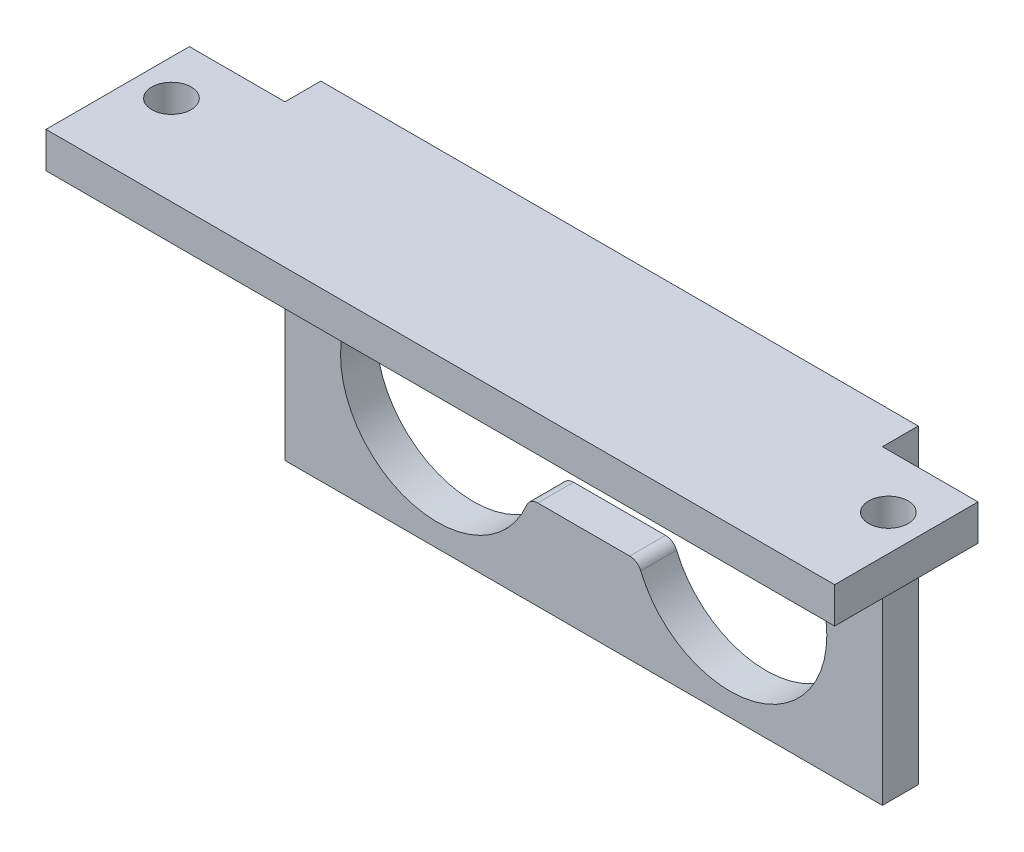
ISO-10303-21;
HEADER;
FILE_DESCRIPTION(('STEP AP214'),'2;1');
FILE_NAME('part.step','',(''),(''),'','','');
FILE_SCHEMA(('AUTOMOTIVE_DESIGN { 1 0 10303 214 1 1 1 1 }'));
ENDSEC;
DATA;
#1=APPLICATION_CONTEXT('core data for automotive mechanical design processes');
#2=APPLICATION_PROTOCOL_DEFINITION('international standard','automotive_design',2000,#1);
#3=PRODUCT_CONTEXT('',#1,'mechanical');
#4=PRODUCT('Part','Part','',(#3));
#5=PRODUCT_RELATED_PRODUCT_CATEGORY('part','',(#4));
#6=PRODUCT_DEFINITION_FORMATION('','',#4);
#7=PRODUCT_DEFINITION_CONTEXT('part definition',#1,'design');
#8=PRODUCT_DEFINITION('design','',#6,#7);
#9=PRODUCT_DEFINITION_SHAPE('','',#8);
#10=(LENGTH_UNIT() NAMED_UNIT(*) SI_UNIT(.MILLI.,.METRE.));
#11=(NAMED_UNIT(*) PLANE_ANGLE_UNIT() SI_UNIT($,.RADIAN.));
#12=(NAMED_UNIT(*) SI_UNIT($,.STERADIAN.) SOLID_ANGLE_UNIT());
#13=UNCERTAINTY_MEASURE_WITH_UNIT(LENGTH_MEASURE(1.E-05),#10,'distance_accuracy_value','');
#14=(GEOMETRIC_REPRESENTATION_CONTEXT(3) GLOBAL_UNCERTAINTY_ASSIGNED_CONTEXT((#13)) GLOBAL_UNIT_ASSIGNED_CONTEXT((#10,
#11,#12)) REPRESENTATION_CONTEXT('',''));
#15=CARTESIAN_POINT('',(0.,0.,0.));
#16=DIRECTION('',(0.,0.,1.));
#17=DIRECTION('',(1.,0.,0.));
#18=AXIS2_PLACEMENT_3D('',#15,#16,#17);
#19=CARTESIAN_POINT('',(25.,-10.,3.));
#20=DIRECTION('',(-1.,0.,0.));
#21=DIRECTION('',(0.,0.,1.));
#22=AXIS2_PLACEMENT_3D('',#19,#20,#21);
#23=PLANE('',#22);
#24=DIRECTION('',(0.,1.,0.));
#25=VECTOR('',#24,1.);
#26=CARTESIAN_POINT('',(25.,13.,3.));
#27=LINE('',#26,#25);
#28=CARTESIAN_POINT('',(25.,13.,3.));
#29=VERTEX_POINT('',#28);
#30=CARTESIAN_POINT('',(25.,16.,3.));
#31=VERTEX_POINT('',#30);
#32=EDGE_CURVE('E219',#29,#31,#27,.T.);
#33=ORIENTED_EDGE('',*,*,#32,.F.);
#34=DIRECTION('',(0.,1.,0.));
#35=VECTOR('',#34,1.);
#36=CARTESIAN_POINT('',(25.,-10.,3.));
#37=LINE('',#36,#35);
#38=CARTESIAN_POINT('',(25.,-10.,3.));
#39=VERTEX_POINT('',#38);
#40=EDGE_CURVE('E213',#39,#29,#37,.T.);
#41=ORIENTED_EDGE('',*,*,#40,.F.);
#42=DIRECTION('',(0.,0.,-1.));
#43=VECTOR('',#42,1.);
#44=CARTESIAN_POINT('',(25.,-10.,3.));
#45=LINE('',#44,#43);
#46=CARTESIAN_POINT('',(25.,-10.,0.));
#47=VERTEX_POINT('',#46);
#48=EDGE_CURVE('E45',#39,#47,#45,.T.);
#49=ORIENTED_EDGE('',*,*,#48,.T.);
#50=DIRECTION('',(0.,1.,0.));
#51=VECTOR('',#50,1.);
#52=CARTESIAN_POINT('',(25.,-10.,0.));
#53=LINE('',#52,#51);
#54=CARTESIAN_POINT('',(25.,16.,0.));
#55=VERTEX_POINT('',#54);
#56=EDGE_CURVE('E207',#47,#55,#53,.T.);
#57=ORIENTED_EDGE('',*,*,#56,.T.);
#58=DIRECTION('',(0.,0.,-1.));
#59=VECTOR('',#58,1.);
#60=CARTESIAN_POINT('',(25.,16.,0.));
#61=LINE('',#60,#59);
#62=EDGE_CURVE('E224',#31,#55,#61,.T.);
#63=ORIENTED_EDGE('',*,*,#62,.F.);
#64=EDGE_LOOP('',(#33,#41,#49,#57,#63));
#65=FACE_BOUND('',#64,.T.);
#66=ADVANCED_FACE('F37',(#65),#23,.F.);
#67=CARTESIAN_POINT('',(-25.,16.,15.));
#68=DIRECTION('',(0.,0.,-1.));
#69=DIRECTION('',(-1.,0.,0.));
#70=AXIS2_PLACEMENT_3D('',#67,#68,#69);
#71=PLANE('',#70);
#72=DIRECTION('',(-1.,0.,0.));
#73=VECTOR('',#72,1.);
#74=CARTESIAN_POINT('',(25.,13.,15.));
#75=LINE('',#74,#73);
#76=CARTESIAN_POINT('',(33.,13.,15.));
#77=VERTEX_POINT('',#76);
#78=CARTESIAN_POINT('',(-33.,13.,15.));
#79=VERTEX_POINT('',#78);
#80=EDGE_CURVE('E215',#77,#79,#75,.T.);
#81=ORIENTED_EDGE('',*,*,#80,.F.);
#82=DIRECTION('',(0.,1.,0.));
#83=VECTOR('',#82,1.);
#84=CARTESIAN_POINT('',(33.,13.,15.));
#85=LINE('',#84,#83);
#86=CARTESIAN_POINT('',(33.,16.,15.));
#87=VERTEX_POINT('',#86);
#88=EDGE_CURVE('E346',#77,#87,#85,.T.);
#89=ORIENTED_EDGE('',*,*,#88,.T.);
#90=DIRECTION('',(1.,0.,0.));
#91=VECTOR('',#90,1.);
#92=CARTESIAN_POINT('',(-25.,16.,15.));
#93=LINE('',#92,#91);
#94=CARTESIAN_POINT('',(-33.,16.,15.));
#95=VERTEX_POINT('',#94);
#96=EDGE_CURVE('E217',#95,#87,#93,.T.);
#97=ORIENTED_EDGE('',*,*,#96,.F.);
#98=DIRECTION('',(0.,1.,0.));
#99=VECTOR('',#98,1.);
#100=CARTESIAN_POINT('',(-33.,13.,15.));
#101=LINE('',#100,#99);
#102=EDGE_CURVE('E366',#79,#95,#101,.T.);
#103=ORIENTED_EDGE('',*,*,#102,.F.);
#104=EDGE_LOOP('',(#81,#89,#97,#103));
#105=FACE_BOUND('',#104,.T.);
#106=ADVANCED_FACE('F401',(#105),#71,.F.);
#107=CARTESIAN_POINT('',(0.,0.,3.));
#108=DIRECTION('',(0.,0.,1.));
#109=DIRECTION('',(1.,0.,0.));
#110=AXIS2_PLACEMENT_3D('',#107,#108,#109);
#111=PLANE('',#110);
#112=DIRECTION('',(0.,-1.,0.));
#113=VECTOR('',#112,1.);
#114=CARTESIAN_POINT('',(-25.,-10.,3.));
#115=LINE('',#114,#113);
#116=CARTESIAN_POINT('',(-25.,13.,3.));
#117=VERTEX_POINT('',#116);
#118=CARTESIAN_POINT('',(-25.,-10.,3.));
#119=VERTEX_POINT('',#118);
#120=EDGE_CURVE('E203',#117,#119,#115,.T.);
#121=ORIENTED_EDGE('',*,*,#120,.T.);
#122=DIRECTION('',(1.,0.,0.));
#123=VECTOR('',#122,1.);
#124=CARTESIAN_POINT('',(25.,-10.,3.));
#125=LINE('',#124,#123);
#126=EDGE_CURVE('E206',#119,#39,#125,.T.);
#127=ORIENTED_EDGE('',*,*,#126,.T.);
#128=ORIENTED_EDGE('',*,*,#40,.T.);
#129=DIRECTION('',(1.,0.,0.));
#130=VECTOR('',#129,1.);
#131=CARTESIAN_POINT('',(25.,13.,3.));
#132=LINE('',#131,#130);
#133=EDGE_CURVE('E196',#117,#29,#132,.T.);
#134=ORIENTED_EDGE('',*,*,#133,.F.);
#135=EDGE_LOOP('',(#121,#127,#128,#134));
#136=FACE_BOUND('',#135,.T.);
#137=CARTESIAN_POINT('',(12.25,0.,3.));
#138=DIRECTION('',(0.,0.,1.));
#139=DIRECTION('',(1.,0.,0.));
#140=AXIS2_PLACEMENT_3D('',#137,#138,#139);
#141=CIRCLE('',#140,8.1);
#142=CARTESIAN_POINT('',(4.77307692307692,-3.11538461538461,3.));
#143=VERTEX_POINT('',#142);
#144=CARTESIAN_POINT('',(4.77307692307692,3.11538461538462,3.));
#145=VERTEX_POINT('',#144);
#146=EDGE_CURVE('E261',#143,#145,#141,.T.);
#147=ORIENTED_EDGE('',*,*,#146,.F.);
#148=CARTESIAN_POINT('',(3.85,-3.5,3.));
#149=DIRECTION('',(0.,0.,-1.));
#150=DIRECTION('',(-1.,0.,0.));
#151=AXIS2_PLACEMENT_3D('',#148,#149,#150);
#152=CIRCLE('',#151,1.);
#153=CARTESIAN_POINT('',(3.85,-2.5,3.));
#154=VERTEX_POINT('',#153);
#155=EDGE_CURVE('E259',#154,#143,#152,.T.);
#156=ORIENTED_EDGE('',*,*,#155,.F.);
#157=DIRECTION('',(1.,0.,0.));
#158=VECTOR('',#157,1.);
#159=CARTESIAN_POINT('',(3.85,-2.5,3.));
#160=LINE('',#159,#158);
#161=CARTESIAN_POINT('',(-3.85,-2.5,3.));
#162=VERTEX_POINT('',#161);
#163=EDGE_CURVE('E275',#162,#154,#160,.T.);
#164=ORIENTED_EDGE('',*,*,#163,.F.);
#165=CARTESIAN_POINT('',(-3.85,-3.5,3.));
#166=DIRECTION('',(0.,0.,-1.));
#167=DIRECTION('',(1.,0.,0.));
#168=AXIS2_PLACEMENT_3D('',#165,#166,#167);
#169=CIRCLE('',#168,1.);
#170=CARTESIAN_POINT('',(-4.77307692307692,-3.11538461538462,3.));
#171=VERTEX_POINT('',#170);
#172=EDGE_CURVE('E272',#171,#162,#169,.T.);
#173=ORIENTED_EDGE('',*,*,#172,.F.);
#174=CARTESIAN_POINT('',(-12.25,0.,3.));
#175=DIRECTION('',(0.,0.,1.));
#176=DIRECTION('',(1.,0.,0.));
#177=AXIS2_PLACEMENT_3D('',#174,#175,#176);
#178=CIRCLE('',#177,8.1);
#179=CARTESIAN_POINT('',(-4.77307692307692,3.11538461538461,3.));
#180=VERTEX_POINT('',#179);
#181=EDGE_CURVE('E270',#180,#171,#178,.T.);
#182=ORIENTED_EDGE('',*,*,#181,.F.);
#183=CARTESIAN_POINT('',(-3.85,3.5,3.));
#184=DIRECTION('',(0.,0.,-1.));
#185=DIRECTION('',(-1.,0.,0.));
#186=AXIS2_PLACEMENT_3D('',#183,#184,#185);
#187=CIRCLE('',#186,1.);
#188=CARTESIAN_POINT('',(-3.85,2.5,3.));
#189=VERTEX_POINT('',#188);
#190=EDGE_CURVE('E268',#189,#180,#187,.T.);
#191=ORIENTED_EDGE('',*,*,#190,.F.);
#192=DIRECTION('',(-1.,0.,0.));
#193=VECTOR('',#192,1.);
#194=CARTESIAN_POINT('',(-3.85,2.5,3.));
#195=LINE('',#194,#193);
#196=CARTESIAN_POINT('',(3.85,2.5,3.));
#197=VERTEX_POINT('',#196);
#198=EDGE_CURVE('E266',#197,#189,#195,.T.);
#199=ORIENTED_EDGE('',*,*,#198,.F.);
#200=CARTESIAN_POINT('',(3.85,3.5,3.));
#201=DIRECTION('',(0.,0.,-1.));
#202=DIRECTION('',(1.,0.,0.));
#203=AXIS2_PLACEMENT_3D('',#200,#201,#202);
#204=CIRCLE('',#203,1.);
#205=EDGE_CURVE('E264',#145,#197,#204,.T.);
#206=ORIENTED_EDGE('',*,*,#205,.F.);
#207=EDGE_LOOP('',(#147,#156,#164,#173,#182,#191,#199,#206));
#208=FACE_BOUND('',#207,.T.);
#209=DIRECTION('',(-1.,0.,0.));
#210=VECTOR('',#209,1.);
#211=CARTESIAN_POINT('',(3.25,9.,3.));
#212=LINE('',#211,#210);
#213=CARTESIAN_POINT('',(3.25,9.,3.));
#214=VERTEX_POINT('',#213);
#215=CARTESIAN_POINT('',(-3.25,9.,3.));
#216=VERTEX_POINT('',#215);
#217=EDGE_CURVE('E232',#214,#216,#212,.T.);
#218=ORIENTED_EDGE('',*,*,#217,.F.);
#219=CARTESIAN_POINT('',(3.25,7.25,3.));
#220=DIRECTION('',(0.,0.,1.));
#221=DIRECTION('',(1.,0.,0.));
#222=AXIS2_PLACEMENT_3D('',#219,#220,#221);
#223=CIRCLE('',#222,1.75);
#224=CARTESIAN_POINT('',(3.25,5.5,3.));
#225=VERTEX_POINT('',#224);
#226=EDGE_CURVE('E230',#225,#214,#223,.T.);
#227=ORIENTED_EDGE('',*,*,#226,.F.);
#228=DIRECTION('',(1.,0.,0.));
#229=VECTOR('',#228,1.);
#230=CARTESIAN_POINT('',(3.25,5.5,3.));
#231=LINE('',#230,#229);
#232=CARTESIAN_POINT('',(-3.25,5.5,3.));
#233=VERTEX_POINT('',#232);
#234=EDGE_CURVE('E237',#233,#225,#231,.T.);
#235=ORIENTED_EDGE('',*,*,#234,.F.);
#236=CARTESIAN_POINT('',(-3.25,7.25,3.));
#237=DIRECTION('',(0.,0.,1.));
#238=DIRECTION('',(1.,0.,0.));
#239=AXIS2_PLACEMENT_3D('',#236,#237,#238);
#240=CIRCLE('',#239,1.75);
#241=EDGE_CURVE('E235',#216,#233,#240,.T.);
#242=ORIENTED_EDGE('',*,*,#241,.F.);
#243=EDGE_LOOP('',(#218,#227,#235,#242));
#244=FACE_BOUND('',#243,.T.);
#245=ADVANCED_FACE('F210',(#136,#208,#244),#111,.T.);
#246=CARTESIAN_POINT('',(0.,0.,0.));
#247=DIRECTION('',(0.,0.,1.));
#248=DIRECTION('',(1.,0.,0.));
#249=AXIS2_PLACEMENT_3D('',#246,#247,#248);
#250=PLANE('',#249);
#251=CARTESIAN_POINT('',(3.85,-3.5,0.));
#252=DIRECTION('',(0.,0.,-1.));
#253=DIRECTION('',(-1.,0.,0.));
#254=AXIS2_PLACEMENT_3D('',#251,#252,#253);
#255=CIRCLE('',#254,1.);
#256=CARTESIAN_POINT('',(3.85,-2.5,0.));
#257=VERTEX_POINT('',#256);
#258=CARTESIAN_POINT('',(4.77307692307692,-3.11538461538461,0.));
#259=VERTEX_POINT('',#258);
#260=EDGE_CURVE('E258',#257,#259,#255,.T.);
#261=ORIENTED_EDGE('',*,*,#260,.T.);
#262=CARTESIAN_POINT('',(12.25,0.,0.));
#263=DIRECTION('',(0.,0.,1.));
#264=DIRECTION('',(1.,0.,0.));
#265=AXIS2_PLACEMENT_3D('',#262,#263,#264);
#266=CIRCLE('',#265,8.1);
#267=CARTESIAN_POINT('',(4.77307692307692,3.11538461538462,0.));
#268=VERTEX_POINT('',#267);
#269=EDGE_CURVE('E280',#259,#268,#266,.T.);
#270=ORIENTED_EDGE('',*,*,#269,.T.);
#271=CARTESIAN_POINT('',(3.85,3.5,0.));
#272=DIRECTION('',(0.,0.,-1.));
#273=DIRECTION('',(1.,0.,0.));
#274=AXIS2_PLACEMENT_3D('',#271,#272,#273);
#275=CIRCLE('',#274,1.);
#276=CARTESIAN_POINT('',(3.85,2.5,0.));
#277=VERTEX_POINT('',#276);
#278=EDGE_CURVE('E283',#268,#277,#275,.T.);
#279=ORIENTED_EDGE('',*,*,#278,.T.);
#280=DIRECTION('',(-1.,0.,0.));
#281=VECTOR('',#280,1.);
#282=CARTESIAN_POINT('',(-3.85,2.5,0.));
#283=LINE('',#282,#281);
#284=CARTESIAN_POINT('',(-3.85,2.5,0.));
#285=VERTEX_POINT('',#284);
#286=EDGE_CURVE('E286',#277,#285,#283,.T.);
#287=ORIENTED_EDGE('',*,*,#286,.T.);
#288=CARTESIAN_POINT('',(-3.85,3.5,0.));
#289=DIRECTION('',(0.,0.,-1.));
#290=DIRECTION('',(-1.,0.,0.));
#291=AXIS2_PLACEMENT_3D('',#288,#289,#290);
#292=CIRCLE('',#291,1.);
#293=CARTESIAN_POINT('',(-4.77307692307692,3.11538461538461,0.));
#294=VERTEX_POINT('',#293);
#295=EDGE_CURVE('E289',#285,#294,#292,.T.);
#296=ORIENTED_EDGE('',*,*,#295,.T.);
#297=CARTESIAN_POINT('',(-12.25,0.,0.));
#298=DIRECTION('',(0.,0.,1.));
#299=DIRECTION('',(1.,0.,0.));
#300=AXIS2_PLACEMENT_3D('',#297,#298,#299);
#301=CIRCLE('',#300,8.1);
#302=CARTESIAN_POINT('',(-4.77307692307692,-3.11538461538462,0.));
#303=VERTEX_POINT('',#302);
#304=EDGE_CURVE('E292',#294,#303,#301,.T.);
#305=ORIENTED_EDGE('',*,*,#304,.T.);
#306=CARTESIAN_POINT('',(-3.85,-3.5,0.));
#307=DIRECTION('',(0.,0.,-1.));
#308=DIRECTION('',(1.,0.,0.));
#309=AXIS2_PLACEMENT_3D('',#306,#307,#308);
#310=CIRCLE('',#309,1.);
#311=CARTESIAN_POINT('',(-3.85,-2.5,0.));
#312=VERTEX_POINT('',#311);
#313=EDGE_CURVE('E295',#303,#312,#310,.T.);
#314=ORIENTED_EDGE('',*,*,#313,.T.);
#315=DIRECTION('',(1.,0.,0.));
#316=VECTOR('',#315,1.);
#317=CARTESIAN_POINT('',(3.85,-2.5,0.));
#318=LINE('',#317,#316);
#319=EDGE_CURVE('E262',#312,#257,#318,.T.);
#320=ORIENTED_EDGE('',*,*,#319,.T.);
#321=EDGE_LOOP('',(#261,#270,#279,#287,#296,#305,#314,#320));
#322=FACE_BOUND('',#321,.T.);
#323=DIRECTION('',(0.,-1.,0.));
#324=VECTOR('',#323,1.);
#325=CARTESIAN_POINT('',(-25.,-10.,0.));
#326=LINE('',#325,#324);
#327=CARTESIAN_POINT('',(-25.,16.,0.));
#328=VERTEX_POINT('',#327);
#329=CARTESIAN_POINT('',(-25.,-10.,0.));
#330=VERTEX_POINT('',#329);
#331=EDGE_CURVE('E316',#328,#330,#326,.T.);
#332=ORIENTED_EDGE('',*,*,#331,.F.);
#333=DIRECTION('',(-1.,0.,0.));
#334=VECTOR('',#333,1.);
#335=CARTESIAN_POINT('',(-25.,16.,0.));
#336=LINE('',#335,#334);
#337=EDGE_CURVE('E226',#55,#328,#336,.T.);
#338=ORIENTED_EDGE('',*,*,#337,.F.);
#339=ORIENTED_EDGE('',*,*,#56,.F.);
#340=DIRECTION('',(1.,0.,0.));
#341=VECTOR('',#340,1.);
#342=CARTESIAN_POINT('',(25.,-10.,0.));
#343=LINE('',#342,#341);
#344=EDGE_CURVE('E321',#330,#47,#343,.T.);
#345=ORIENTED_EDGE('',*,*,#344,.F.);
#346=EDGE_LOOP('',(#332,#338,#339,#345));
#347=FACE_BOUND('',#346,.T.);
#348=CARTESIAN_POINT('',(3.25,7.25,0.));
#349=DIRECTION('',(0.,0.,1.));
#350=DIRECTION('',(1.,0.,0.));
#351=AXIS2_PLACEMENT_3D('',#348,#349,#350);
#352=CIRCLE('',#351,1.75);
#353=CARTESIAN_POINT('',(3.25,5.5,0.));
#354=VERTEX_POINT('',#353);
#355=CARTESIAN_POINT('',(3.25,9.,0.));
#356=VERTEX_POINT('',#355);
#357=EDGE_CURVE('E229',#354,#356,#352,.T.);
#358=ORIENTED_EDGE('',*,*,#357,.T.);
#359=DIRECTION('',(-1.,0.,0.));
#360=VECTOR('',#359,1.);
#361=CARTESIAN_POINT('',(3.25,9.,0.));
#362=LINE('',#361,#360);
#363=CARTESIAN_POINT('',(-3.25,9.,0.));
#364=VERTEX_POINT('',#363);
#365=EDGE_CURVE('E242',#356,#364,#362,.T.);
#366=ORIENTED_EDGE('',*,*,#365,.T.);
#367=CARTESIAN_POINT('',(-3.25,7.25,0.));
#368=DIRECTION('',(0.,0.,1.));
#369=DIRECTION('',(1.,0.,0.));
#370=AXIS2_PLACEMENT_3D('',#367,#368,#369);
#371=CIRCLE('',#370,1.75);
#372=CARTESIAN_POINT('',(-3.25,5.5,0.));
#373=VERTEX_POINT('',#372);
#374=EDGE_CURVE('E245',#364,#373,#371,.T.);
#375=ORIENTED_EDGE('',*,*,#374,.T.);
#376=DIRECTION('',(1.,0.,0.));
#377=VECTOR('',#376,1.);
#378=CARTESIAN_POINT('',(3.25,5.5,0.));
#379=LINE('',#378,#377);
#380=EDGE_CURVE('E233',#373,#354,#379,.T.);
#381=ORIENTED_EDGE('',*,*,#380,.T.);
#382=EDGE_LOOP('',(#358,#366,#375,#381));
#383=FACE_BOUND('',#382,.T.);
#384=ADVANCED_FACE('F331',(#322,#347,#383),#250,.F.);
#385=CARTESIAN_POINT('',(-25.,-10.,3.));
#386=DIRECTION('',(1.,0.,0.));
#387=DIRECTION('',(0.,0.,-1.));
#388=AXIS2_PLACEMENT_3D('',#385,#386,#387);
#389=PLANE('',#388);
#390=ORIENTED_EDGE('',*,*,#120,.F.);
#391=DIRECTION('',(0.,1.,0.));
#392=VECTOR('',#391,1.);
#393=CARTESIAN_POINT('',(-25.,13.,3.));
#394=LINE('',#393,#392);
#395=CARTESIAN_POINT('',(-25.,16.,3.));
#396=VERTEX_POINT('',#395);
#397=EDGE_CURVE('E178',#117,#396,#394,.T.);
#398=ORIENTED_EDGE('',*,*,#397,.T.);
#399=DIRECTION('',(0.,0.,1.));
#400=VECTOR('',#399,1.);
#401=CARTESIAN_POINT('',(-25.,16.,0.));
#402=LINE('',#401,#400);
#403=EDGE_CURVE('E214',#328,#396,#402,.T.);
#404=ORIENTED_EDGE('',*,*,#403,.F.);
#405=ORIENTED_EDGE('',*,*,#331,.T.);
#406=DIRECTION('',(0.,0.,-1.));
#407=VECTOR('',#406,1.);
#408=CARTESIAN_POINT('',(-25.,-10.,3.));
#409=LINE('',#408,#407);
#410=EDGE_CURVE('E11',#119,#330,#409,.T.);
#411=ORIENTED_EDGE('',*,*,#410,.F.);
#412=EDGE_LOOP('',(#390,#398,#404,#405,#411));
#413=FACE_BOUND('',#412,.T.);
#414=ADVANCED_FACE('F39',(#413),#389,.F.);
#415=CARTESIAN_POINT('',(25.,-10.,3.));
#416=DIRECTION('',(0.,1.,0.));
#417=DIRECTION('',(-1.,0.,0.));
#418=AXIS2_PLACEMENT_3D('',#415,#416,#417);
#419=PLANE('',#418);
#420=ORIENTED_EDGE('',*,*,#344,.T.);
#421=ORIENTED_EDGE('',*,*,#48,.F.);
#422=ORIENTED_EDGE('',*,*,#126,.F.);
#423=ORIENTED_EDGE('',*,*,#410,.T.);
#424=EDGE_LOOP('',(#420,#421,#422,#423));
#425=FACE_BOUND('',#424,.T.);
#426=ADVANCED_FACE('F408',(#425),#419,.F.);
#427=CARTESIAN_POINT('',(3.85,-3.5,3.));
#428=DIRECTION('',(0.,0.,-1.));
#429=DIRECTION('',(-1.,0.,0.));
#430=AXIS2_PLACEMENT_3D('',#427,#428,#429);
#431=CYLINDRICAL_SURFACE('',#430,1.);
#432=ORIENTED_EDGE('',*,*,#260,.F.);
#433=DIRECTION('',(0.,0.,-1.));
#434=VECTOR('',#433,1.);
#435=CARTESIAN_POINT('',(3.85,-2.5,3.));
#436=LINE('',#435,#434);
#437=EDGE_CURVE('E277',#154,#257,#436,.T.);
#438=ORIENTED_EDGE('',*,*,#437,.F.);
#439=ORIENTED_EDGE('',*,*,#155,.T.);
#440=DIRECTION('',(0.,0.,-1.));
#441=VECTOR('',#440,1.);
#442=CARTESIAN_POINT('',(4.77307692307692,-3.11538461538461,3.));
#443=LINE('',#442,#441);
#444=EDGE_CURVE('E314',#143,#259,#443,.T.);
#445=ORIENTED_EDGE('',*,*,#444,.T.);
#446=EDGE_LOOP('',(#432,#438,#439,#445));
#447=FACE_BOUND('',#446,.T.);
#448=ADVANCED_FACE('F410',(#447),#431,.T.);
#449=CARTESIAN_POINT('',(12.25,0.,3.));
#450=DIRECTION('',(0.,0.,-1.));
#451=DIRECTION('',(-1.,0.,0.));
#452=AXIS2_PLACEMENT_3D('',#449,#450,#451);
#453=CYLINDRICAL_SURFACE('',#452,8.1);
#454=ORIENTED_EDGE('',*,*,#269,.F.);
#455=ORIENTED_EDGE('',*,*,#444,.F.);
#456=ORIENTED_EDGE('',*,*,#146,.T.);
#457=DIRECTION('',(0.,0.,-1.));
#458=VECTOR('',#457,1.);
#459=CARTESIAN_POINT('',(4.77307692307692,3.11538461538462,3.));
#460=LINE('',#459,#458);
#461=EDGE_CURVE('E312',#145,#268,#460,.T.);
#462=ORIENTED_EDGE('',*,*,#461,.T.);
#463=EDGE_LOOP('',(#454,#455,#456,#462));
#464=FACE_BOUND('',#463,.T.);
#465=ADVANCED_FACE('F415',(#464),#453,.F.);
#466=CARTESIAN_POINT('',(3.85,3.5,3.));
#467=DIRECTION('',(0.,0.,-1.));
#468=DIRECTION('',(-1.,0.,0.));
#469=AXIS2_PLACEMENT_3D('',#466,#467,#468);
#470=CYLINDRICAL_SURFACE('',#469,1.);
#471=ORIENTED_EDGE('',*,*,#278,.F.);
#472=ORIENTED_EDGE('',*,*,#461,.F.);
#473=ORIENTED_EDGE('',*,*,#205,.T.);
#474=DIRECTION('',(0.,0.,-1.));
#475=VECTOR('',#474,1.);
#476=CARTESIAN_POINT('',(3.85,2.5,3.));
#477=LINE('',#476,#475);
#478=EDGE_CURVE('E310',#197,#277,#477,.T.);
#479=ORIENTED_EDGE('',*,*,#478,.T.);
#480=EDGE_LOOP('',(#471,#472,#473,#479));
#481=FACE_BOUND('',#480,.T.);
#482=ADVANCED_FACE('F441',(#481),#470,.T.);
#483=CARTESIAN_POINT('',(-3.85,2.5,3.));
#484=DIRECTION('',(0.,-1.,0.));
#485=DIRECTION('',(0.,0.,-1.));
#486=AXIS2_PLACEMENT_3D('',#483,#484,#485);
#487=PLANE('',#486);
#488=ORIENTED_EDGE('',*,*,#286,.F.);
#489=ORIENTED_EDGE('',*,*,#478,.F.);
#490=ORIENTED_EDGE('',*,*,#198,.T.);
#491=DIRECTION('',(0.,0.,-1.));
#492=VECTOR('',#491,1.);
#493=CARTESIAN_POINT('',(-3.85,2.5,3.));
#494=LINE('',#493,#492);
#495=EDGE_CURVE('E308',#189,#285,#494,.T.);
#496=ORIENTED_EDGE('',*,*,#495,.T.);
#497=EDGE_LOOP('',(#488,#489,#490,#496));
#498=FACE_BOUND('',#497,.T.);
#499=ADVANCED_FACE('F446',(#498),#487,.T.);
#500=CARTESIAN_POINT('',(-3.85,3.5,3.));
#501=DIRECTION('',(0.,0.,-1.));
#502=DIRECTION('',(-1.,0.,0.));
#503=AXIS2_PLACEMENT_3D('',#500,#501,#502);
#504=CYLINDRICAL_SURFACE('',#503,1.);
#505=ORIENTED_EDGE('',*,*,#295,.F.);
#506=ORIENTED_EDGE('',*,*,#495,.F.);
#507=ORIENTED_EDGE('',*,*,#190,.T.);
#508=DIRECTION('',(0.,0.,-1.));
#509=VECTOR('',#508,1.);
#510=CARTESIAN_POINT('',(-4.77307692307692,3.11538461538461,3.));
#511=LINE('',#510,#509);
#512=EDGE_CURVE('E306',#180,#294,#511,.T.);
#513=ORIENTED_EDGE('',*,*,#512,.T.);
#514=EDGE_LOOP('',(#505,#506,#507,#513));
#515=FACE_BOUND('',#514,.T.);
#516=ADVANCED_FACE('F451',(#515),#504,.T.);
#517=CARTESIAN_POINT('',(-12.25,0.,3.));
#518=DIRECTION('',(0.,0.,-1.));
#519=DIRECTION('',(-1.,0.,0.));
#520=AXIS2_PLACEMENT_3D('',#517,#518,#519);
#521=CYLINDRICAL_SURFACE('',#520,8.1);
#522=ORIENTED_EDGE('',*,*,#304,.F.);
#523=ORIENTED_EDGE('',*,*,#512,.F.);
#524=ORIENTED_EDGE('',*,*,#181,.T.);
#525=DIRECTION('',(0.,0.,-1.));
#526=VECTOR('',#525,1.);
#527=CARTESIAN_POINT('',(-4.77307692307692,-3.11538461538462,3.));
#528=LINE('',#527,#526);
#529=EDGE_CURVE('E304',#171,#303,#528,.T.);
#530=ORIENTED_EDGE('',*,*,#529,.T.);
#531=EDGE_LOOP('',(#522,#523,#524,#530));
#532=FACE_BOUND('',#531,.T.);
#533=ADVANCED_FACE('F455',(#532),#521,.F.);
#534=CARTESIAN_POINT('',(-3.85,-3.5,3.));
#535=DIRECTION('',(0.,0.,-1.));
#536=DIRECTION('',(-1.,0.,0.));
#537=AXIS2_PLACEMENT_3D('',#534,#535,#536);
#538=CYLINDRICAL_SURFACE('',#537,1.);
#539=ORIENTED_EDGE('',*,*,#313,.F.);
#540=ORIENTED_EDGE('',*,*,#529,.F.);
#541=ORIENTED_EDGE('',*,*,#172,.T.);
#542=DIRECTION('',(0.,0.,-1.));
#543=VECTOR('',#542,1.);
#544=CARTESIAN_POINT('',(-3.85,-2.5,3.));
#545=LINE('',#544,#543);
#546=EDGE_CURVE('E302',#162,#312,#545,.T.);
#547=ORIENTED_EDGE('',*,*,#546,.T.);
#548=EDGE_LOOP('',(#539,#540,#541,#547));
#549=FACE_BOUND('',#548,.T.);
#550=ADVANCED_FACE('F459',(#549),#538,.T.);
#551=CARTESIAN_POINT('',(3.85,-2.5,3.));
#552=DIRECTION('',(0.,1.,0.));
#553=DIRECTION('',(-1.,0.,0.));
#554=AXIS2_PLACEMENT_3D('',#551,#552,#553);
#555=PLANE('',#554);
#556=ORIENTED_EDGE('',*,*,#319,.F.);
#557=ORIENTED_EDGE('',*,*,#546,.F.);
#558=ORIENTED_EDGE('',*,*,#163,.T.);
#559=ORIENTED_EDGE('',*,*,#437,.T.);
#560=EDGE_LOOP('',(#556,#557,#558,#559));
#561=FACE_BOUND('',#560,.T.);
#562=ADVANCED_FACE('F430',(#561),#555,.T.);
#563=CARTESIAN_POINT('',(3.25,7.25,3.));
#564=DIRECTION('',(0.,0.,-1.));
#565=DIRECTION('',(-1.,0.,0.));
#566=AXIS2_PLACEMENT_3D('',#563,#564,#565);
#567=CYLINDRICAL_SURFACE('',#566,1.75);
#568=ORIENTED_EDGE('',*,*,#357,.F.);
#569=DIRECTION('',(0.,0.,-1.));
#570=VECTOR('',#569,1.);
#571=CARTESIAN_POINT('',(3.25,5.5,3.));
#572=LINE('',#571,#570);
#573=EDGE_CURVE('E239',#225,#354,#572,.T.);
#574=ORIENTED_EDGE('',*,*,#573,.F.);
#575=ORIENTED_EDGE('',*,*,#226,.T.);
#576=DIRECTION('',(0.,0.,-1.));
#577=VECTOR('',#576,1.);
#578=CARTESIAN_POINT('',(3.25,9.,3.));
#579=LINE('',#578,#577);
#580=EDGE_CURVE('E255',#214,#356,#579,.T.);
#581=ORIENTED_EDGE('',*,*,#580,.T.);
#582=EDGE_LOOP('',(#568,#574,#575,#581));
#583=FACE_BOUND('',#582,.T.);
#584=ADVANCED_FACE('F466',(#583),#567,.F.);
#585=CARTESIAN_POINT('',(3.25,9.,3.));
#586=DIRECTION('',(0.,-1.,0.));
#587=DIRECTION('',(1.,0.,0.));
#588=AXIS2_PLACEMENT_3D('',#585,#586,#587);
#589=PLANE('',#588);
#590=ORIENTED_EDGE('',*,*,#365,.F.);
#591=ORIENTED_EDGE('',*,*,#580,.F.);
#592=ORIENTED_EDGE('',*,*,#217,.T.);
#593=DIRECTION('',(0.,0.,-1.));
#594=VECTOR('',#593,1.);
#595=CARTESIAN_POINT('',(-3.25,9.,3.));
#596=LINE('',#595,#594);
#597=EDGE_CURVE('E253',#216,#364,#596,.T.);
#598=ORIENTED_EDGE('',*,*,#597,.T.);
#599=EDGE_LOOP('',(#590,#591,#592,#598));
#600=FACE_BOUND('',#599,.T.);
#601=ADVANCED_FACE('F517',(#600),#589,.T.);
#602=CARTESIAN_POINT('',(-3.25,7.25,3.));
#603=DIRECTION('',(0.,0.,-1.));
#604=DIRECTION('',(-1.,0.,0.));
#605=AXIS2_PLACEMENT_3D('',#602,#603,#604);
#606=CYLINDRICAL_SURFACE('',#605,1.75);
#607=ORIENTED_EDGE('',*,*,#374,.F.);
#608=ORIENTED_EDGE('',*,*,#597,.F.);
#609=ORIENTED_EDGE('',*,*,#241,.T.);
#610=DIRECTION('',(0.,0.,-1.));
#611=VECTOR('',#610,1.);
#612=CARTESIAN_POINT('',(-3.25,5.5,3.));
#613=LINE('',#612,#611);
#614=EDGE_CURVE('E60',#233,#373,#613,.T.);
#615=ORIENTED_EDGE('',*,*,#614,.T.);
#616=EDGE_LOOP('',(#607,#608,#609,#615));
#617=FACE_BOUND('',#616,.T.);
#618=ADVANCED_FACE('F397',(#617),#606,.F.);
#619=CARTESIAN_POINT('',(3.25,5.5,3.));
#620=DIRECTION('',(0.,1.,0.));
#621=DIRECTION('',(0.,0.,1.));
#622=AXIS2_PLACEMENT_3D('',#619,#620,#621);
#623=PLANE('',#622);
#624=ORIENTED_EDGE('',*,*,#380,.F.);
#625=ORIENTED_EDGE('',*,*,#614,.F.);
#626=ORIENTED_EDGE('',*,*,#234,.T.);
#627=ORIENTED_EDGE('',*,*,#573,.T.);
#628=EDGE_LOOP('',(#624,#625,#626,#627));
#629=FACE_BOUND('',#628,.T.);
#630=ADVANCED_FACE('F390',(#629),#623,.T.);
#631=CARTESIAN_POINT('',(0.,16.,0.));
#632=DIRECTION('',(0.,1.,0.));
#633=DIRECTION('',(-1.,0.,0.));
#634=AXIS2_PLACEMENT_3D('',#631,#632,#633);
#635=PLANE('',#634);
#636=ORIENTED_EDGE('',*,*,#403,.T.);
#637=DIRECTION('',(-1.,0.,0.));
#638=VECTOR('',#637,1.);
#639=CARTESIAN_POINT('',(-25.,16.,3.));
#640=LINE('',#639,#638);
#641=CARTESIAN_POINT('',(-33.,16.,3.));
#642=VERTEX_POINT('',#641);
#643=EDGE_CURVE('E52',#396,#642,#640,.T.);
#644=ORIENTED_EDGE('',*,*,#643,.T.);
#645=DIRECTION('',(0.,0.,1.));
#646=VECTOR('',#645,1.);
#647=CARTESIAN_POINT('',(-33.,16.,15.));
#648=LINE('',#647,#646);
#649=EDGE_CURVE('E199',#642,#95,#648,.T.);
#650=ORIENTED_EDGE('',*,*,#649,.T.);
#651=ORIENTED_EDGE('',*,*,#96,.T.);
#652=DIRECTION('',(0.,0.,-1.));
#653=VECTOR('',#652,1.);
#654=CARTESIAN_POINT('',(33.,16.,15.));
#655=LINE('',#654,#653);
#656=CARTESIAN_POINT('',(33.,16.,3.));
#657=VERTEX_POINT('',#656);
#658=EDGE_CURVE('E359',#87,#657,#655,.T.);
#659=ORIENTED_EDGE('',*,*,#658,.T.);
#660=DIRECTION('',(-1.,0.,0.));
#661=VECTOR('',#660,1.);
#662=CARTESIAN_POINT('',(25.,16.,3.));
#663=LINE('',#662,#661);
#664=EDGE_CURVE('E339',#657,#31,#663,.T.);
#665=ORIENTED_EDGE('',*,*,#664,.T.);
#666=ORIENTED_EDGE('',*,*,#62,.T.);
#667=ORIENTED_EDGE('',*,*,#337,.T.);
#668=EDGE_LOOP('',(#636,#644,#650,#651,#659,#665,#666,#667));
#669=FACE_BOUND('',#668,.T.);
#670=CARTESIAN_POINT('',(30.,16.,7.5));
#671=DIRECTION('',(0.,1.,0.));
#672=DIRECTION('',(-1.,0.,0.));
#673=AXIS2_PLACEMENT_3D('',#670,#671,#672);
#674=CIRCLE('',#673,1.65000000000001);
#675=CARTESIAN_POINT('',(28.35,16.,7.5));
#676=VERTEX_POINT('',#675);
#677=EDGE_CURVE('E362',#676,#676,#674,.T.);
#678=ORIENTED_EDGE('',*,*,#677,.F.);
#679=EDGE_LOOP('',(#678));
#680=FACE_BOUND('',#679,.T.);
#681=CARTESIAN_POINT('',(-30.,16.,7.5));
#682=DIRECTION('',(0.,1.,0.));
#683=DIRECTION('',(-1.,0.,0.));
#684=AXIS2_PLACEMENT_3D('',#681,#682,#683);
#685=CIRCLE('',#684,1.65);
#686=CARTESIAN_POINT('',(-31.65,16.,7.5));
#687=VERTEX_POINT('',#686);
#688=EDGE_CURVE('E376',#687,#687,#685,.T.);
#689=ORIENTED_EDGE('',*,*,#688,.F.);
#690=EDGE_LOOP('',(#689));
#691=FACE_BOUND('',#690,.T.);
#692=ADVANCED_FACE('F334',(#669,#680,#691),#635,.T.);
#693=CARTESIAN_POINT('',(0.,13.,0.));
#694=DIRECTION('',(0.,-1.,0.));
#695=DIRECTION('',(1.,0.,0.));
#696=AXIS2_PLACEMENT_3D('',#693,#694,#695);
#697=PLANE('',#696);
#698=ORIENTED_EDGE('',*,*,#133,.T.);
#699=DIRECTION('',(-1.,0.,0.));
#700=VECTOR('',#699,1.);
#701=CARTESIAN_POINT('',(25.,13.,3.));
#702=LINE('',#701,#700);
#703=CARTESIAN_POINT('',(33.,13.,3.));
#704=VERTEX_POINT('',#703);
#705=EDGE_CURVE('E343',#704,#29,#702,.T.);
#706=ORIENTED_EDGE('',*,*,#705,.F.);
#707=DIRECTION('',(0.,0.,-1.));
#708=VECTOR('',#707,1.);
#709=CARTESIAN_POINT('',(33.,13.,15.));
#710=LINE('',#709,#708);
#711=EDGE_CURVE('E354',#77,#704,#710,.T.);
#712=ORIENTED_EDGE('',*,*,#711,.F.);
#713=ORIENTED_EDGE('',*,*,#80,.T.);
#714=DIRECTION('',(0.,0.,1.));
#715=VECTOR('',#714,1.);
#716=CARTESIAN_POINT('',(-33.,13.,15.));
#717=LINE('',#716,#715);
#718=CARTESIAN_POINT('',(-33.,13.,3.));
#719=VERTEX_POINT('',#718);
#720=EDGE_CURVE('E187',#719,#79,#717,.T.);
#721=ORIENTED_EDGE('',*,*,#720,.F.);
#722=DIRECTION('',(-1.,0.,0.));
#723=VECTOR('',#722,1.);
#724=CARTESIAN_POINT('',(-25.,13.,3.));
#725=LINE('',#724,#723);
#726=EDGE_CURVE('E181',#117,#719,#725,.T.);
#727=ORIENTED_EDGE('',*,*,#726,.F.);
#728=EDGE_LOOP('',(#698,#706,#712,#713,#721,#727));
#729=FACE_BOUND('',#728,.T.);
#730=CARTESIAN_POINT('',(30.,13.,7.5));
#731=DIRECTION('',(0.,1.,0.));
#732=DIRECTION('',(-1.,0.,0.));
#733=AXIS2_PLACEMENT_3D('',#730,#731,#732);
#734=CIRCLE('',#733,1.65000000000001);
#735=CARTESIAN_POINT('',(28.35,13.,7.5));
#736=VERTEX_POINT('',#735);
#737=EDGE_CURVE('E360',#736,#736,#734,.T.);
#738=ORIENTED_EDGE('',*,*,#737,.T.);
#739=EDGE_LOOP('',(#738));
#740=FACE_BOUND('',#739,.T.);
#741=CARTESIAN_POINT('',(-30.,13.,7.5));
#742=DIRECTION('',(0.,1.,0.));
#743=DIRECTION('',(-1.,0.,0.));
#744=AXIS2_PLACEMENT_3D('',#741,#742,#743);
#745=CIRCLE('',#744,1.65);
#746=CARTESIAN_POINT('',(-31.65,13.,7.5));
#747=VERTEX_POINT('',#746);
#748=EDGE_CURVE('E374',#747,#747,#745,.T.);
#749=ORIENTED_EDGE('',*,*,#748,.T.);
#750=EDGE_LOOP('',(#749));
#751=FACE_BOUND('',#750,.T.);
#752=ADVANCED_FACE('F192',(#729,#740,#751),#697,.T.);
#753=CARTESIAN_POINT('',(25.,13.,3.));
#754=DIRECTION('',(0.,0.,-1.));
#755=DIRECTION('',(0.,1.,0.));
#756=AXIS2_PLACEMENT_3D('',#753,#754,#755);
#757=PLANE('',#756);
#758=ORIENTED_EDGE('',*,*,#664,.F.);
#759=DIRECTION('',(0.,1.,0.));
#760=VECTOR('',#759,1.);
#761=CARTESIAN_POINT('',(33.,13.,3.));
#762=LINE('',#761,#760);
#763=EDGE_CURVE('E344',#704,#657,#762,.T.);
#764=ORIENTED_EDGE('',*,*,#763,.F.);
#765=ORIENTED_EDGE('',*,*,#705,.T.);
#766=ORIENTED_EDGE('',*,*,#32,.T.);
#767=EDGE_LOOP('',(#758,#764,#765,#766));
#768=FACE_BOUND('',#767,.T.);
#769=ADVANCED_FACE('F342',(#768),#757,.T.);
#770=CARTESIAN_POINT('',(33.,13.,15.));
#771=DIRECTION('',(1.,0.,0.));
#772=DIRECTION('',(0.,1.,0.));
#773=AXIS2_PLACEMENT_3D('',#770,#771,#772);
#774=PLANE('',#773);
#775=ORIENTED_EDGE('',*,*,#658,.F.);
#776=ORIENTED_EDGE('',*,*,#88,.F.);
#777=ORIENTED_EDGE('',*,*,#711,.T.);
#778=ORIENTED_EDGE('',*,*,#763,.T.);
#779=EDGE_LOOP('',(#775,#776,#777,#778));
#780=FACE_BOUND('',#779,.T.);
#781=ADVANCED_FACE('F594',(#780),#774,.T.);
#782=CARTESIAN_POINT('',(30.,13.,7.5));
#783=DIRECTION('',(0.,1.,0.));
#784=DIRECTION('',(-1.,0.,0.));
#785=AXIS2_PLACEMENT_3D('',#782,#783,#784);
#786=CYLINDRICAL_SURFACE('',#785,1.65000000000001);
#787=ORIENTED_EDGE('',*,*,#737,.F.);
#788=EDGE_LOOP('',(#787));
#789=FACE_BOUND('',#788,.T.);
#790=ORIENTED_EDGE('',*,*,#677,.T.);
#791=EDGE_LOOP('',(#790));
#792=FACE_BOUND('',#791,.T.);
#793=ADVANCED_FACE('F603',(#789,#792),#786,.F.);
#794=CARTESIAN_POINT('',(-33.,13.,15.));
#795=DIRECTION('',(-1.,0.,0.));
#796=DIRECTION('',(0.,-1.,0.));
#797=AXIS2_PLACEMENT_3D('',#794,#795,#796);
#798=PLANE('',#797);
#799=ORIENTED_EDGE('',*,*,#649,.F.);
#800=DIRECTION('',(0.,1.,0.));
#801=VECTOR('',#800,1.);
#802=CARTESIAN_POINT('',(-33.,13.,3.));
#803=LINE('',#802,#801);
#804=EDGE_CURVE('E186',#719,#642,#803,.T.);
#805=ORIENTED_EDGE('',*,*,#804,.F.);
#806=ORIENTED_EDGE('',*,*,#720,.T.);
#807=ORIENTED_EDGE('',*,*,#102,.T.);
#808=EDGE_LOOP('',(#799,#805,#806,#807));
#809=FACE_BOUND('',#808,.T.);
#810=ADVANCED_FACE('F613',(#809),#798,.T.);
#811=CARTESIAN_POINT('',(-25.,13.,3.));
#812=DIRECTION('',(0.,0.,-1.));
#813=DIRECTION('',(-1.,0.,0.));
#814=AXIS2_PLACEMENT_3D('',#811,#812,#813);
#815=PLANE('',#814);
#816=ORIENTED_EDGE('',*,*,#643,.F.);
#817=ORIENTED_EDGE('',*,*,#397,.F.);
#818=ORIENTED_EDGE('',*,*,#726,.T.);
#819=ORIENTED_EDGE('',*,*,#804,.T.);
#820=EDGE_LOOP('',(#816,#817,#818,#819));
#821=FACE_BOUND('',#820,.T.);
#822=ADVANCED_FACE('F180',(#821),#815,.T.);
#823=CARTESIAN_POINT('',(-30.,13.,7.5));
#824=DIRECTION('',(0.,1.,0.));
#825=DIRECTION('',(-1.,0.,0.));
#826=AXIS2_PLACEMENT_3D('',#823,#824,#825);
#827=CYLINDRICAL_SURFACE('',#826,1.65);
#828=ORIENTED_EDGE('',*,*,#748,.F.);
#829=EDGE_LOOP('',(#828));
#830=FACE_BOUND('',#829,.T.);
#831=ORIENTED_EDGE('',*,*,#688,.T.);
#832=EDGE_LOOP('',(#831));
#833=FACE_BOUND('',#832,.T.);
#834=ADVANCED_FACE('F383',(#830,#833),#827,.F.);
#835=CLOSED_SHELL('',(#66,#106,#245,#384,#414,#426,#448,#465,#482,#499,#516,#533,#550,#562,#584,
#601,#618,#630,#692,#752,#769,#781,#793,#810,#822,#834));
#836=MANIFOLD_SOLID_BREP('B2',#835);
#837=ADVANCED_BREP_SHAPE_REPRESENTATION('',(#18,#836),#14);
#838=SHAPE_DEFINITION_REPRESENTATION(#9,#837);
ENDSEC;
END-ISO-10303-21;
